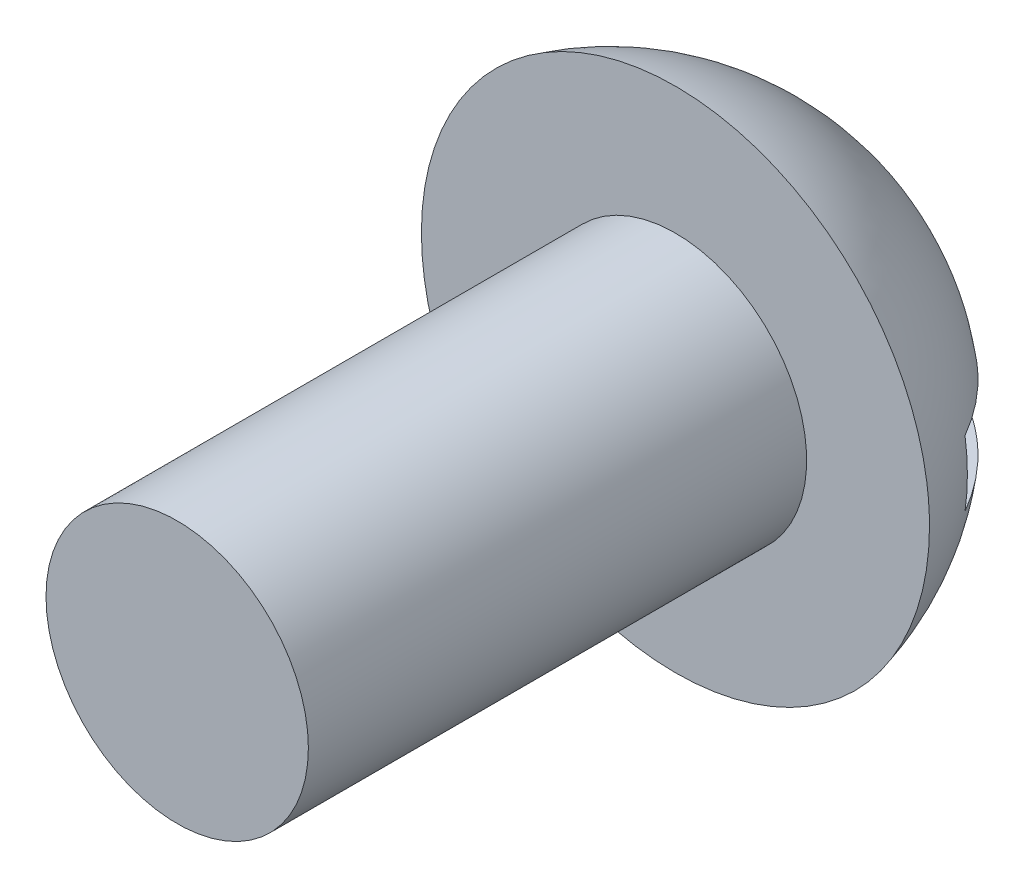
ISO-10303-21;
HEADER;
FILE_DESCRIPTION(('STEP AP214'),'2;1');
FILE_NAME('part.step','',(''),(''),'','','');
FILE_SCHEMA(('AUTOMOTIVE_DESIGN { 1 0 10303 214 1 1 1 1 }'));
ENDSEC;
DATA;
#1=APPLICATION_CONTEXT('core data for automotive mechanical design processes');
#2=APPLICATION_PROTOCOL_DEFINITION('international standard','automotive_design',2000,#1);
#3=PRODUCT_CONTEXT('',#1,'mechanical');
#4=PRODUCT('Part','Part','',(#3));
#5=PRODUCT_RELATED_PRODUCT_CATEGORY('part','',(#4));
#6=PRODUCT_DEFINITION_FORMATION('','',#4);
#7=PRODUCT_DEFINITION_CONTEXT('part definition',#1,'design');
#8=PRODUCT_DEFINITION('design','',#6,#7);
#9=PRODUCT_DEFINITION_SHAPE('','',#8);
#10=(LENGTH_UNIT() NAMED_UNIT(*) SI_UNIT(.MILLI.,.METRE.));
#11=(NAMED_UNIT(*) PLANE_ANGLE_UNIT() SI_UNIT($,.RADIAN.));
#12=(NAMED_UNIT(*) SI_UNIT($,.STERADIAN.) SOLID_ANGLE_UNIT());
#13=UNCERTAINTY_MEASURE_WITH_UNIT(LENGTH_MEASURE(1.E-05),#10,'distance_accuracy_value','');
#14=(GEOMETRIC_REPRESENTATION_CONTEXT(3) GLOBAL_UNCERTAINTY_ASSIGNED_CONTEXT((#13)) GLOBAL_UNIT_ASSIGNED_CONTEXT((#10,
#11,#12)) REPRESENTATION_CONTEXT('',''));
#15=CARTESIAN_POINT('',(0.,0.,0.));
#16=DIRECTION('',(0.,0.,1.));
#17=DIRECTION('',(1.,0.,0.));
#18=AXIS2_PLACEMENT_3D('',#15,#16,#17);
#19=CARTESIAN_POINT('',(0.,15.282157927206,23.48865));
#20=DIRECTION('',(0.,0.,1.));
#21=DIRECTION('',(0.,1.,0.));
#22=AXIS2_PLACEMENT_3D('',#19,#20,#21);
#23=SPHERICAL_SURFACE('',#22,2.5146);
#24=CARTESIAN_POINT('',(0.,15.282157927206,22.86));
#25=DIRECTION('',(0.,0.,1.));
#26=DIRECTION('',(1.,0.,0.));
#27=AXIS2_PLACEMENT_3D('',#24,#25,#26);
#28=CIRCLE('',#27,2.43475098059329);
#29=CARTESIAN_POINT('',(2.43475098059329,15.282157927206,22.86));
#30=VERTEX_POINT('',#29);
#31=EDGE_CURVE('E74',#30,#30,#28,.T.);
#32=ORIENTED_EDGE('',*,*,#31,.F.);
#33=EDGE_LOOP('',(#32));
#34=FACE_BOUND('',#33,.T.);
#35=CARTESIAN_POINT('',(0.,15.282157927206,22.2510726574489));
#36=DIRECTION('',(0.,0.,-1.));
#37=DIRECTION('',(0.,1.,0.));
#38=AXIS2_PLACEMENT_3D('',#35,#36,#37);
#39=CIRCLE('',#38,2.18897589781251);
#40=CARTESIAN_POINT('',(2.16629067199651,15.596482927206,22.2510726574489));
#41=VERTEX_POINT('',#40);
#42=CARTESIAN_POINT('',(2.16629067199651,14.967832927206,22.2510726574489));
#43=VERTEX_POINT('',#42);
#44=EDGE_CURVE('E67',#41,#43,#39,.T.);
#45=ORIENTED_EDGE('',*,*,#44,.F.);
#46=CARTESIAN_POINT('',(0.,15.596482927206,23.48865));
#47=DIRECTION('',(0.,1.,0.));
#48=DIRECTION('',(0.,0.,1.));
#49=AXIS2_PLACEMENT_3D('',#46,#47,#48);
#50=CIRCLE('',#49,2.49487734255113);
#51=CARTESIAN_POINT('',(-2.16629067199651,15.596482927206,22.2510726574489));
#52=VERTEX_POINT('',#51);
#53=EDGE_CURVE('E80',#41,#52,#50,.T.);
#54=ORIENTED_EDGE('',*,*,#53,.T.);
#55=CARTESIAN_POINT('',(0.,15.282157927206,22.2510726574489));
#56=DIRECTION('',(0.,0.,1.));
#57=DIRECTION('',(0.,-1.,0.));
#58=AXIS2_PLACEMENT_3D('',#55,#56,#57);
#59=CIRCLE('',#58,2.18897589781251);
#60=CARTESIAN_POINT('',(-2.16629067199651,14.967832927206,22.2510726574489));
#61=VERTEX_POINT('',#60);
#62=EDGE_CURVE('E42',#52,#61,#59,.T.);
#63=ORIENTED_EDGE('',*,*,#62,.T.);
#64=CARTESIAN_POINT('',(0.,14.967832927206,23.48865));
#65=DIRECTION('',(0.,-1.,0.));
#66=DIRECTION('',(0.,0.,-1.));
#67=AXIS2_PLACEMENT_3D('',#64,#65,#66);
#68=CIRCLE('',#67,2.49487734255113);
#69=EDGE_CURVE('E11',#61,#43,#68,.T.);
#70=ORIENTED_EDGE('',*,*,#69,.T.);
#71=EDGE_LOOP('',(#45,#54,#63,#70));
#72=FACE_BOUND('',#71,.T.);
#73=ADVANCED_FACE('F34',(#34,#72),#23,.T.);
#74=CARTESIAN_POINT('',(0.,17.7169089077993,22.86));
#75=DIRECTION('',(0.,0.,-1.));
#76=DIRECTION('',(-1.,0.,0.));
#77=AXIS2_PLACEMENT_3D('',#74,#75,#76);
#78=PLANE('',#77);
#79=ORIENTED_EDGE('',*,*,#31,.T.);
#80=EDGE_LOOP('',(#79));
#81=FACE_BOUND('',#80,.T.);
#82=CARTESIAN_POINT('',(0.,15.24,22.86));
#83=DIRECTION('',(0.,0.,-1.));
#84=DIRECTION('',(-1.,0.,0.));
#85=AXIS2_PLACEMENT_3D('',#82,#83,#84);
#86=CIRCLE('',#85,1.2573);
#87=CARTESIAN_POINT('',(-1.2573,15.24,22.86));
#88=VERTEX_POINT('',#87);
#89=EDGE_CURVE('E77',#88,#88,#86,.F.);
#90=ORIENTED_EDGE('',*,*,#89,.F.);
#91=EDGE_LOOP('',(#90));
#92=FACE_BOUND('',#91,.T.);
#93=ADVANCED_FACE('F36',(#81,#92),#78,.F.);
#94=CARTESIAN_POINT('',(0.,15.24,27.6352));
#95=DIRECTION('',(0.,0.,-1.));
#96=DIRECTION('',(-1.,0.,0.));
#97=AXIS2_PLACEMENT_3D('',#94,#95,#96);
#98=CYLINDRICAL_SURFACE('',#97,1.2573);
#99=CARTESIAN_POINT('',(0.,15.24,27.6352));
#100=DIRECTION('',(0.,0.,1.));
#101=DIRECTION('',(1.,0.,0.));
#102=AXIS2_PLACEMENT_3D('',#99,#100,#101);
#103=CIRCLE('',#102,1.2573);
#104=CARTESIAN_POINT('',(1.2573,15.24,27.6352));
#105=VERTEX_POINT('',#104);
#106=EDGE_CURVE('E61',#105,#105,#103,.T.);
#107=ORIENTED_EDGE('',*,*,#106,.F.);
#108=EDGE_LOOP('',(#107));
#109=FACE_BOUND('',#108,.T.);
#110=ORIENTED_EDGE('',*,*,#89,.T.);
#111=EDGE_LOOP('',(#110));
#112=FACE_BOUND('',#111,.T.);
#113=ADVANCED_FACE('F95',(#109,#112),#98,.T.);
#114=CARTESIAN_POINT('',(0.,15.24,27.6352));
#115=DIRECTION('',(0.,0.,1.));
#116=DIRECTION('',(1.,0.,0.));
#117=AXIS2_PLACEMENT_3D('',#114,#115,#116);
#118=PLANE('',#117);
#119=ORIENTED_EDGE('',*,*,#106,.T.);
#120=EDGE_LOOP('',(#119));
#121=FACE_BOUND('',#120,.T.);
#122=ADVANCED_FACE('F100',(#121),#118,.T.);
#123=CARTESIAN_POINT('',(-2.43475098059329,14.967832927206,22.2510726574489));
#124=DIRECTION('',(0.,-1.,0.));
#125=DIRECTION('',(0.,0.,-1.));
#126=AXIS2_PLACEMENT_3D('',#123,#124,#125);
#127=PLANE('',#126);
#128=DIRECTION('',(1.,0.,0.));
#129=VECTOR('',#128,1.);
#130=CARTESIAN_POINT('',(-2.43475098059329,14.967832927206,22.2510726574489));
#131=LINE('',#130,#129);
#132=EDGE_CURVE('E58',#61,#43,#131,.T.);
#133=ORIENTED_EDGE('',*,*,#132,.T.);
#134=ORIENTED_EDGE('',*,*,#69,.F.);
#135=EDGE_LOOP('',(#133,#134));
#136=FACE_BOUND('',#135,.T.);
#137=ADVANCED_FACE('F59',(#136),#127,.F.);
#138=CARTESIAN_POINT('',(-2.43475098059329,15.596482927206,22.2510726574489));
#139=DIRECTION('',(0.,0.,1.));
#140=DIRECTION('',(0.,-1.,0.));
#141=AXIS2_PLACEMENT_3D('',#138,#139,#140);
#142=PLANE('',#141);
#143=DIRECTION('',(1.,0.,0.));
#144=VECTOR('',#143,1.);
#145=CARTESIAN_POINT('',(-2.43475098059329,15.596482927206,22.2510726574489));
#146=LINE('',#145,#144);
#147=EDGE_CURVE('E62',#52,#41,#146,.T.);
#148=ORIENTED_EDGE('',*,*,#147,.T.);
#149=ORIENTED_EDGE('',*,*,#44,.T.);
#150=ORIENTED_EDGE('',*,*,#132,.F.);
#151=ORIENTED_EDGE('',*,*,#62,.F.);
#152=EDGE_LOOP('',(#148,#149,#150,#151));
#153=FACE_BOUND('',#152,.T.);
#154=ADVANCED_FACE('F68',(#153),#142,.F.);
#155=CARTESIAN_POINT('',(-2.43475098059329,15.596482927206,22.2510726574489));
#156=DIRECTION('',(0.,1.,0.));
#157=DIRECTION('',(0.,0.,1.));
#158=AXIS2_PLACEMENT_3D('',#155,#156,#157);
#159=PLANE('',#158);
#160=ORIENTED_EDGE('',*,*,#53,.F.);
#161=ORIENTED_EDGE('',*,*,#147,.F.);
#162=EDGE_LOOP('',(#160,#161));
#163=FACE_BOUND('',#162,.T.);
#164=ADVANCED_FACE('F82',(#163),#159,.F.);
#165=CLOSED_SHELL('',(#73,#93,#113,#122,#137,#154,#164));
#166=MANIFOLD_SOLID_BREP('B2',#165);
#167=ADVANCED_BREP_SHAPE_REPRESENTATION('',(#18,#166),#14);
#168=SHAPE_DEFINITION_REPRESENTATION(#9,#167);
ENDSEC;
END-ISO-10303-21;
